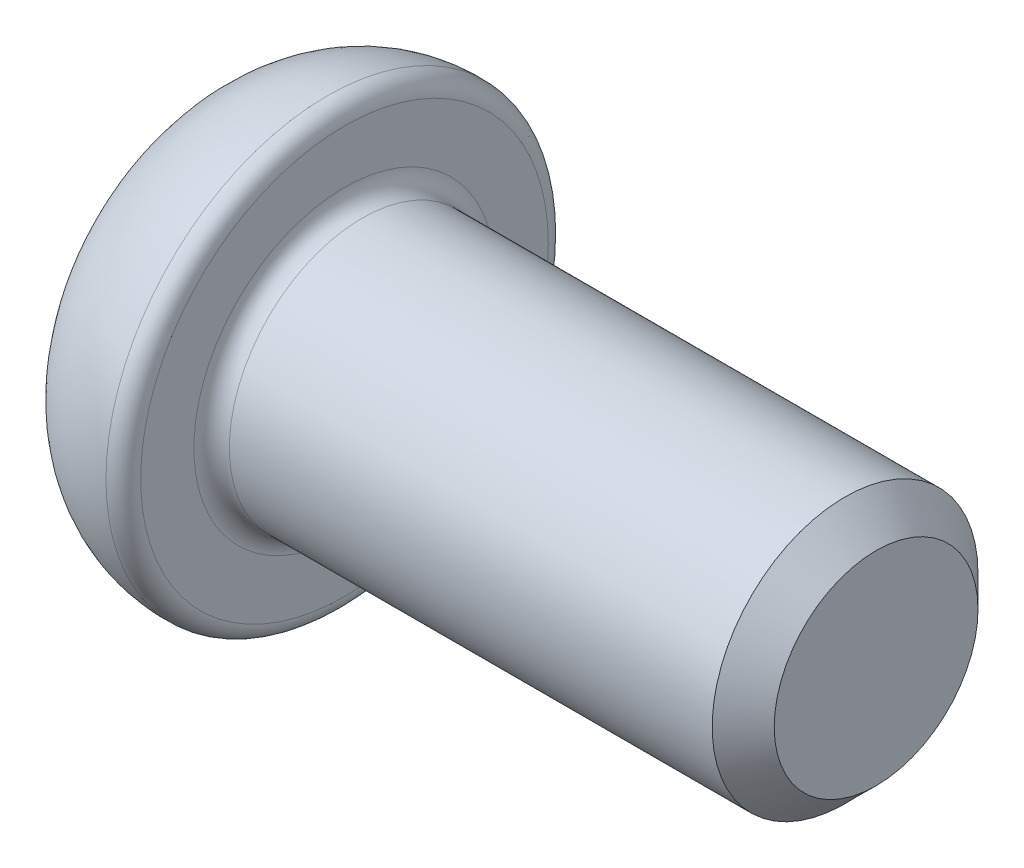
ISO-10303-21;
HEADER;
FILE_DESCRIPTION(('STEP AP214'),'2;1');
FILE_NAME('part.step','',(''),(''),'','','');
FILE_SCHEMA(('AUTOMOTIVE_DESIGN { 1 0 10303 214 1 1 1 1 }'));
ENDSEC;
DATA;
#1=APPLICATION_CONTEXT('core data for automotive mechanical design processes');
#2=APPLICATION_PROTOCOL_DEFINITION('international standard','automotive_design',2000,#1);
#3=PRODUCT_CONTEXT('',#1,'mechanical');
#4=PRODUCT('Part','Part','',(#3));
#5=PRODUCT_RELATED_PRODUCT_CATEGORY('part','',(#4));
#6=PRODUCT_DEFINITION_FORMATION('','',#4);
#7=PRODUCT_DEFINITION_CONTEXT('part definition',#1,'design');
#8=PRODUCT_DEFINITION('design','',#6,#7);
#9=PRODUCT_DEFINITION_SHAPE('','',#8);
#10=(LENGTH_UNIT() NAMED_UNIT(*) SI_UNIT(.MILLI.,.METRE.));
#11=(NAMED_UNIT(*) PLANE_ANGLE_UNIT() SI_UNIT($,.RADIAN.));
#12=(NAMED_UNIT(*) SI_UNIT($,.STERADIAN.) SOLID_ANGLE_UNIT());
#13=UNCERTAINTY_MEASURE_WITH_UNIT(LENGTH_MEASURE(1.E-05),#10,'distance_accuracy_value','');
#14=(GEOMETRIC_REPRESENTATION_CONTEXT(3) GLOBAL_UNCERTAINTY_ASSIGNED_CONTEXT((#13)) GLOBAL_UNIT_ASSIGNED_CONTEXT((#10,
#11,#12)) REPRESENTATION_CONTEXT('',''));
#15=CARTESIAN_POINT('',(0.,0.,0.));
#16=DIRECTION('',(0.,0.,1.));
#17=DIRECTION('',(1.,0.,0.));
#18=AXIS2_PLACEMENT_3D('',#15,#16,#17);
#19=CARTESIAN_POINT('',(1.5,0.,0.));
#20=DIRECTION('',(1.,0.,0.));
#21=DIRECTION('',(0.,0.,-1.));
#22=AXIS2_PLACEMENT_3D('',#19,#20,#21);
#23=DEGENERATE_TOROIDAL_SURFACE('',#22,1.00110987806539,1.5,.T.);
#24=CARTESIAN_POINT('',(0.00789597542149041,-1.15481600843309,-0.000200000000000142));
#25=CARTESIAN_POINT('',(0.00542604693692045,-1.13076586513082,0.0414560701288516));
#26=CARTESIAN_POINT('',(0.00376082343034832,-1.10670231337504,0.0831353643804187));
#27=CARTESIAN_POINT('',(0.00148854197993975,-1.05856787998182,0.166506648611014));
#28=CARTESIAN_POINT('',(0.00088121307622223,-1.03449700180118,0.208198632602691));
#29=CARTESIAN_POINT('',(0.000172853298911107,-0.986360312777249,0.291573823700276));
#30=CARTESIAN_POINT('',(7.17121196707583E-05,-0.962294501972819,0.33325703073889));
#31=CARTESIAN_POINT('',(-1.45135273849101E-05,-0.914160928715452,0.416626825170486));
#32=CARTESIAN_POINT('',(4.10598332002454E-07,-0.890093166249946,0.458313412585243));
#33=CARTESIAN_POINT('',(4.10598331977648E-07,-0.841957641318932,0.541686587414757));
#34=CARTESIAN_POINT('',(-1.45135273849597E-05,-0.817889878853425,0.583373174829514));
#35=CARTESIAN_POINT('',(7.17121196706029E-05,-0.769756305596059,0.666742969261111));
#36=CARTESIAN_POINT('',(0.00017285329891087,-0.745690494791629,0.708426176299724));
#37=CARTESIAN_POINT('',(0.000881213076222171,-0.697553805767702,0.791801367397309));
#38=CARTESIAN_POINT('',(0.00148854197993995,-0.673482927587058,0.833493351388986));
#39=CARTESIAN_POINT('',(0.00376082343034881,-0.625348494193839,0.916864635619581));
#40=CARTESIAN_POINT('',(0.00542604693692098,-0.601284942438063,0.958543929871148));
#41=CARTESIAN_POINT('',(0.00789597542149057,-0.577234799135788,1.0002));
#42=B_SPLINE_CURVE_WITH_KNOTS('',3,(#24,#25,#26,#27,#28,#29,#30,#31,#32,#33,#34,#35,#36,#37,#38,
#39,#40,#41),.UNSPECIFIED.,.F.,.F.,(4,2,2,2,2,2,2,2,4),(0.,0.144464197898797,0.288891388556233,
0.433287105063312,0.577693512802,0.722099920540687,0.866495637047766,1.0109228277052,
1.155387025604),.UNSPECIFIED.);
#43=CARTESIAN_POINT('',(0.00788408323465527,-1.15470053837925,0.));
#44=VERTEX_POINT('',#43);
#45=CARTESIAN_POINT('',(0.,-0.889589083251513,0.45918650994976));
#46=VERTEX_POINT('',#45);
#47=EDGE_CURVE('E11',#44,#46,#42,.T.);
#48=ORIENTED_EDGE('',*,*,#47,.F.);
#49=CARTESIAN_POINT('',(0.00789597542149048,-0.577234799135788,-1.0002));
#50=CARTESIAN_POINT('',(0.00542604693692064,-0.601284942438063,-0.958543929871148));
#51=CARTESIAN_POINT('',(0.00376082343034845,-0.625348494193838,-0.916864635619581));
#52=CARTESIAN_POINT('',(0.00148854197993972,-0.673482927587058,-0.833493351388986));
#53=CARTESIAN_POINT('',(0.000881213076222073,-0.697553805767701,-0.791801367397309));
#54=CARTESIAN_POINT('',(0.000172853298910902,-0.745690494791629,-0.708426176299724));
#55=CARTESIAN_POINT('',(7.17121196706246E-05,-0.769756305596059,-0.66674296926111));
#56=CARTESIAN_POINT('',(-1.45135273849426E-05,-0.817889878853425,-0.583373174829514));
#57=CARTESIAN_POINT('',(4.10598331999777E-07,-0.841957641318932,-0.541686587414757));
#58=CARTESIAN_POINT('',(4.10598332010818E-07,-0.890093166249946,-0.458313412585243));
#59=CARTESIAN_POINT('',(-1.45135273849205E-05,-0.914160928715452,-0.416626825170486));
#60=CARTESIAN_POINT('',(7.17121196706303E-05,-0.962294501972819,-0.333257030738889));
#61=CARTESIAN_POINT('',(0.00017285329891088,-0.986360312777249,-0.291573823700276));
#62=CARTESIAN_POINT('',(0.000881213076222154,-1.03449700180118,-0.208198632602691));
#63=CARTESIAN_POINT('',(0.00148854197993993,-1.05856787998182,-0.166506648611014));
#64=CARTESIAN_POINT('',(0.00376082343034877,-1.10670231337504,-0.0831353643804187));
#65=CARTESIAN_POINT('',(0.00542604693692094,-1.13076586513082,-0.0414560701288516));
#66=CARTESIAN_POINT('',(0.00789597542149053,-1.15481600843309,0.000200000000000021));
#67=B_SPLINE_CURVE_WITH_KNOTS('',3,(#49,#50,#51,#52,#53,#54,#55,#56,#57,#58,#59,#60,#61,#62,#63,
#64,#65,#66),.UNSPECIFIED.,.F.,.F.,(4,2,2,2,2,2,2,2,4),(0.,0.144464197898797,0.288891388556234,
0.433287105063313,0.577693512802,0.722099920540687,0.866495637047766,1.0109228277052,
1.155387025604),.UNSPECIFIED.);
#68=CARTESIAN_POINT('',(0.,-0.889589083251518,-0.459186509949751));
#69=VERTEX_POINT('',#68);
#70=EDGE_CURVE('E43',#69,#44,#67,.T.);
#71=ORIENTED_EDGE('',*,*,#70,.F.);
#72=CARTESIAN_POINT('',(0.,-0.842461724317359,-0.540813490050249));
#73=DIRECTION('',(0.,-0.5,0.866025403784439));
#74=VECTOR('',#73,1.);
#75=LINE('',#72,#74);
#76=CARTESIAN_POINT('',(0.,-0.842461724317359,-0.540813490050249));
#77=VERTEX_POINT('',#76);
#78=EDGE_CURVE('E144',#77,#69,#75,.T.);
#79=ORIENTED_EDGE('',*,*,#78,.F.);
#80=CARTESIAN_POINT('',(0.00788408323376384,-0.577350269189626,-1.));
#81=VERTEX_POINT('',#80);
#82=EDGE_CURVE('E264',#81,#77,#67,.T.);
#83=ORIENTED_EDGE('',*,*,#82,.F.);
#84=CARTESIAN_POINT('',(4.10609829497004E-07,0.,-1.));
#85=CARTESIAN_POINT('',(4.42328466909666E-06,-0.0419085481983505,-1.));
#86=CARTESIAN_POINT('',(-8.21434623222068E-06,-0.0838172750016166,-1.));
#87=CARTESIAN_POINT('',(3.87033450213406E-05,-0.167634573211464,-1.));
#88=CARTESIAN_POINT('',(9.82597851806692E-05,-0.209543144605589,-1.));
#89=CARTESIAN_POINT('',(0.00070499754576417,-0.335320966161048,-1.));
#90=CARTESIAN_POINT('',(0.00168067618666049,-0.419193544498606,-1.));
#91=CARTESIAN_POINT('',(0.00764461151773026,-0.586406153161597,-1.));
#92=CARTESIAN_POINT('',(0.0126121175593781,-0.669746696638542,-1.));
#93=CARTESIAN_POINT('',(0.0295261331533725,-0.83570122525872,-1.));
#94=CARTESIAN_POINT('',(0.0414631931255666,-0.918316040720577,-1.));
#95=CARTESIAN_POINT('',(0.0674484119800398,-1.04662047620464,-1.));
#96=CARTESIAN_POINT('',(0.0783907820538363,-1.09293763971261,-1.));
#97=CARTESIAN_POINT('',(0.103556825018407,-1.18467655579779,-1.));
#98=CARTESIAN_POINT('',(0.117781082877188,-1.23009814717855,-1.));
#99=CARTESIAN_POINT('',(0.165760758650998,-1.36460143751692,-1.));
#100=CARTESIAN_POINT('',(0.204817216030264,-1.45189064493554,-1.));
#101=CARTESIAN_POINT('',(0.297974523825678,-1.61898394614429,-1.));
#102=CARTESIAN_POINT('',(0.35218893740739,-1.69872520656462,-1.));
#103=CARTESIAN_POINT('',(0.474746584485199,-1.84655126424678,-1.));
#104=CARTESIAN_POINT('',(0.543083058415181,-1.91464160985451,-1.));
#105=CARTESIAN_POINT('',(0.684131092322764,-2.02968523080252,-1.));
#106=CARTESIAN_POINT('',(0.755654633829852,-2.07809799081724,-1.));
#107=CARTESIAN_POINT('',(0.90631391180589,-2.16110111834147,-1.));
#108=CARTESIAN_POINT('',(0.985445927725428,-2.19569819950334,-1.));
#109=CARTESIAN_POINT('',(1.14268121771474,-2.24767649697595,-1.));
#110=CARTESIAN_POINT('',(1.2204280140045,-2.2661414153489,-1.));
#111=CARTESIAN_POINT('',(1.37794164210725,-2.2893773798721,-1.));
#112=CARTESIAN_POINT('',(1.4577081305444,-2.29415073821622,-1.));
#113=CARTESIAN_POINT('',(1.61481321599969,-2.28989106383948,-1.));
#114=CARTESIAN_POINT('',(1.69216161521913,-2.28120896786852,-1.));
#115=CARTESIAN_POINT('',(1.84428535209312,-2.25098736781229,-1.));
#116=CARTESIAN_POINT('',(1.91906121828266,-2.22945052166288,-1.));
#117=CARTESIAN_POINT('',(2.06402681386593,-2.17423016565249,-1.));
#118=CARTESIAN_POINT('',(2.13421369058889,-2.14053918359733,-1.));
#119=CARTESIAN_POINT('',(2.26814562319367,-2.06211005067895,-1.));
#120=CARTESIAN_POINT('',(2.33188754379213,-2.01736655918569,-1.));
#121=CARTESIAN_POINT('',(2.45291640379922,-1.91701521252381,-1.));
#122=CARTESIAN_POINT('',(2.50999648997609,-1.86115870114487,-1.));
#123=CARTESIAN_POINT('',(2.61456823729596,-1.74117330164202,-1.));
#124=CARTESIAN_POINT('',(2.66206708919118,-1.67705067695628,-1.));
#125=CARTESIAN_POINT('',(2.72702562083354,-1.57403618070324,-1.));
#126=CARTESIAN_POINT('',(2.7481384236323,-1.53738510277309,-1.));
#127=CARTESIAN_POINT('',(2.78750677747445,-1.46255172440874,-1.));
#128=CARTESIAN_POINT('',(2.80576108332104,-1.42436876571588,-1.));
#129=CARTESIAN_POINT('',(2.83943760801177,-1.34674627698638,-1.));
#130=CARTESIAN_POINT('',(2.85485770756991,-1.30730583231143,-1.));
#131=CARTESIAN_POINT('',(2.8829233055067,-1.2275111103957,-1.));
#132=CARTESIAN_POINT('',(2.8955721859095,-1.18715801410307,-1.));
#133=CARTESIAN_POINT('',(2.92560717994761,-1.07934741447146,-1.));
#134=CARTESIAN_POINT('',(2.94075595206167,-1.01126150436534,-1.));
#135=CARTESIAN_POINT('',(2.96494192659386,-0.873996935642961,-1.));
#136=CARTESIAN_POINT('',(2.97397312396569,-0.80481727134182,-1.));
#137=CARTESIAN_POINT('',(2.98735401044195,-0.665607037855779,-1.));
#138=CARTESIAN_POINT('',(2.99167430172838,-0.595573852365373,-1.));
#139=CARTESIAN_POINT('',(2.99728741707113,-0.455421423235627,-1.));
#140=CARTESIAN_POINT('',(2.99858056761844,-0.385302189693224,-1.));
#141=CARTESIAN_POINT('',(2.99993053679468,-0.244192605564413,-1.));
#142=CARTESIAN_POINT('',(2.99997185053451,-0.173202217949213,-1.));
#143=CARTESIAN_POINT('',(3.00001694198291,-0.0312208619107281,-1.));
#144=CARTESIAN_POINT('',(3.00002071942152,0.039770106513061,-1.));
#145=CARTESIAN_POINT('',(2.99996266590596,0.181536770271981,-1.));
#146=CARTESIAN_POINT('',(2.99990103318965,0.252312467826152,-1.));
#147=CARTESIAN_POINT('',(2.99844612985905,0.393847370817269,-1.));
#148=CARTESIAN_POINT('',(2.99705316400949,0.464606576321555,-1.));
#149=CARTESIAN_POINT('',(2.99192378887099,0.586513145111125,-1.));
#150=CARTESIAN_POINT('',(2.98893945435411,0.637688381554001,-1.));
#151=CARTESIAN_POINT('',(2.98061912505216,0.73986457254294,-1.));
#152=CARTESIAN_POINT('',(2.97528280912664,0.790865502330445,-1.));
#153=CARTESIAN_POINT('',(2.96169848596055,0.89211486764435,-1.));
#154=CARTESIAN_POINT('',(2.95347176321928,0.942366077494637,-1.));
#155=CARTESIAN_POINT('',(2.93361221871033,1.042206454069,-1.));
#156=CARTESIAN_POINT('',(2.9219790977349,1.09179556223581,-1.));
#157=CARTESIAN_POINT('',(2.8947305945394,1.19070100385389,-1.));
#158=CARTESIAN_POINT('',(2.87905668628379,1.24000139681552,-1.));
#159=CARTESIAN_POINT('',(2.84356272909895,1.33709264020247,-1.));
#160=CARTESIAN_POINT('',(2.82374288151627,1.38488356380511,-1.));
#161=CARTESIAN_POINT('',(2.77974479017018,1.47862905973547,-1.));
#162=CARTESIAN_POINT('',(2.75555196525035,1.52457684023912,-1.));
#163=CARTESIAN_POINT('',(2.70285432086212,1.61393265779753,-1.));
#164=CARTESIAN_POINT('',(2.67434828547126,1.65733997387812,-1.));
#165=CARTESIAN_POINT('',(2.58635679740163,1.77762818622872,-1.));
#166=CARTESIAN_POINT('',(2.52152071763535,1.8507191168117,-1.));
#167=CARTESIAN_POINT('',(2.37877862123073,1.98250688996699,-1.));
#168=CARTESIAN_POINT('',(2.30089758089029,2.0412307213557,-1.));
#169=CARTESIAN_POINT('',(2.14682688432694,2.13432108196425,-1.));
#170=CARTESIAN_POINT('',(2.07201589863319,2.1709799711724,-1.));
#171=CARTESIAN_POINT('',(1.91705219801623,2.23041477990244,-1.));
#172=CARTESIAN_POINT('',(1.83690038267347,2.25319303087973,-1.));
#173=CARTESIAN_POINT('',(1.67820474377137,2.28315919488511,-1.));
#174=CARTESIAN_POINT('',(1.59980556449175,2.29111836155545,-1.));
#175=CARTESIAN_POINT('',(1.44280709881501,2.29354898626556,-1.));
#176=CARTESIAN_POINT('',(1.36420785518463,2.28802311875751,-1.));
#177=CARTESIAN_POINT('',(1.21022850353374,2.26385733108434,-1.));
#178=CARTESIAN_POINT('',(1.13481825701316,2.24540853638331,-1.));
#179=CARTESIAN_POINT('',(0.988127045734917,2.19622704385844,-1.));
#180=CARTESIAN_POINT('',(0.916845924357541,2.16549481230102,-1.));
#181=CARTESIAN_POINT('',(0.779647528841495,2.09241553598221,-1.));
#182=CARTESIAN_POINT('',(0.713787766297451,2.04996072393427,-1.));
#183=CARTESIAN_POINT('',(0.589811841452605,1.95495464684614,-1.));
#184=CARTESIAN_POINT('',(0.531697259742535,1.9024013262889,-1.));
#185=CARTESIAN_POINT('',(0.422444112952196,1.78675251424863,-1.));
#186=CARTESIAN_POINT('',(0.371643728327023,1.72333860781315,-1.));
#187=CARTESIAN_POINT('',(0.280475002471462,1.58944242546201,-1.));
#188=CARTESIAN_POINT('',(0.240106223052175,1.51896044661974,-1.));
#189=CARTESIAN_POINT('',(0.18150951974811,1.39710092320635,-1.));
#190=CARTESIAN_POINT('',(0.160370151327829,1.34708755884065,-1.));
#191=CARTESIAN_POINT('',(0.122659052549425,1.24535059581546,-1.));
#192=CARTESIAN_POINT('',(0.106088737031122,1.19362647294786,-1.));
#193=CARTESIAN_POINT('',(0.0772291304296833,1.08896976671263,-1.));
#194=CARTESIAN_POINT('',(0.0649432341171994,1.03603626030924,-1.));
#195=CARTESIAN_POINT('',(0.0442125795154655,0.92941652834226,-1.));
#196=CARTESIAN_POINT('',(0.0357692328292896,0.875730033613839,-1.));
#197=CARTESIAN_POINT('',(0.0203517601727118,0.753916684990206,-1.));
#198=CARTESIAN_POINT('',(0.0143337812407774,0.685672328311677,-1.));
#199=CARTESIAN_POINT('',(0.00593818826136508,0.548962040855237,-1.));
#200=CARTESIAN_POINT('',(0.00356229213689224,0.480496020770095,-1.));
#201=CARTESIAN_POINT('',(0.00075099530834381,0.343345939481802,-1.));
#202=CARTESIAN_POINT('',(0.000321069133646188,0.274661806451856,-1.));
#203=CARTESIAN_POINT('',(-5.74283383478992E-05,0.137318609128501,-1.));
#204=CARTESIAN_POINT('',(-6.1634290621822E-06,0.0686595442598229,-1.));
#205=CARTESIAN_POINT('',(4.10609829497004E-07,0.,-1.));
#206=B_SPLINE_CURVE_WITH_KNOTS('',3,(#84,#85,#86,#87,#88,#89,#90,#91,#92,#93,#94,#95,#96,#97,
#98,#99,#100,#101,#102,#103,#104,#105,#106,#107,#108,#109,#110,#111,#112,#113,#114,#115,#116,
#117,#118,#119,#120,#121,#122,#123,#124,#125,#126,#127,#128,#129,#130,#131,#132,#133,#134,#135,
#136,#137,#138,#139,#140,#141,#142,#143,#144,#145,#146,#147,#148,#149,#150,#151,#152,#153,#154,
#155,#156,#157,#158,#159,#160,#161,#162,#163,#164,#165,#166,#167,#168,#169,#170,#171,#172,#173,
#174,#175,#176,#177,#178,#179,#180,#181,#182,#183,#184,#185,#186,#187,#188,#189,#190,#191,#192,
#193,#194,#195,#196,#197,#198,#199,#200,#201,#202,#203,#204,#205),.UNSPECIFIED.,.T.,.F.,(4,2,2,
2,2,2,2,2,2,2,2,2,2,2,2,2,2,2,2,2,2,2,2,2,2,2,2,2,2,2,2,2,2,2,2,2,2,2,2,2,2,2,2,2,2,2,2,2,2,2,2,
2,2,2,2,2,2,2,2,2,4),(0.,0.125725600479263,0.251453147982353,0.503054594322007,
0.753356540800835,1.00331990410247,1.14598386646117,1.28867327710386,1.57414581165066,
1.86181721597596,2.14935124313959,2.40707647549605,2.66467631485744,2.90323119064128,
3.14174577754614,3.37414346217923,3.60649311131931,3.83898584991656,4.07159115072732,
4.31014712126045,4.54852338300294,4.67530946378523,4.80215062143593,4.92908624245996,
5.05586607619062,5.26475303100698,5.47384473446465,5.68423391038394,5.89460039382262,
6.1075713645967,6.32054386706824,6.53287275433508,6.74515304755859,6.89890033687399,
7.05266862540932,7.20532753449955,7.35799985671252,7.51302156854871,7.66803575353944,
7.82357668312269,7.97916154269609,8.27031574685739,8.56091873990167,8.8095729026481,
9.05818528878566,9.29345214695918,9.52867234905339,9.76048522703471,9.9922893064769,
10.2262997307469,10.4603578375944,10.7030866564173,10.9458052775412,11.1084873887412,
11.2712198191887,11.4340808996802,11.5970017607904,11.8023759268642,12.0078469354806,
12.2138956306916,12.4198741911953),.UNSPECIFIED.);
#207=CARTESIAN_POINT('',(0.,-0.0471273589341589,-1.));
#208=VERTEX_POINT('',#207);
#209=EDGE_CURVE('E262',#208,#81,#206,.T.);
#210=ORIENTED_EDGE('',*,*,#209,.F.);
#211=CARTESIAN_POINT('',(0.,0.047127358934159,-1.));
#212=DIRECTION('',(0.,-1.,0.));
#213=VECTOR('',#212,1.);
#214=LINE('',#211,#213);
#215=CARTESIAN_POINT('',(0.,0.0471273589341589,-1.));
#216=VERTEX_POINT('',#215);
#217=EDGE_CURVE('E146',#216,#208,#214,.T.);
#218=ORIENTED_EDGE('',*,*,#217,.F.);
#219=CARTESIAN_POINT('',(0.00788408323465527,0.577350269189626,-1.));
#220=VERTEX_POINT('',#219);
#221=EDGE_CURVE('E259',#220,#216,#206,.T.);
#222=ORIENTED_EDGE('',*,*,#221,.F.);
#223=CARTESIAN_POINT('',(0.00789597542149051,1.15481600843309,0.000199999999999829));
#224=CARTESIAN_POINT('',(0.00542604693692092,1.13076586513082,-0.0414560701288518));
#225=CARTESIAN_POINT('',(0.00376082343034875,1.10670231337504,-0.0831353643804189));
#226=CARTESIAN_POINT('',(0.00148854197993991,1.05856787998182,-0.166506648611014));
#227=CARTESIAN_POINT('',(0.000881213076222141,1.03449700180118,-0.208198632602691));
#228=CARTESIAN_POINT('',(0.000172853298910869,0.986360312777249,-0.291573823700276));
#229=CARTESIAN_POINT('',(7.17121196706199E-05,0.962294501972819,-0.33325703073889));
#230=CARTESIAN_POINT('',(-1.45135273849321E-05,0.914160928715452,-0.416626825170486));
#231=CARTESIAN_POINT('',(4.10598331997919E-07,0.890093166249946,-0.458313412585243));
#232=CARTESIAN_POINT('',(4.10598331995735E-07,0.841957641318932,-0.541686587414757));
#233=CARTESIAN_POINT('',(-1.45135273849365E-05,0.817889878853425,-0.583373174829514));
#234=CARTESIAN_POINT('',(7.17121196706102E-05,0.769756305596059,-0.666742969261111));
#235=CARTESIAN_POINT('',(0.000172853298910857,0.745690494791629,-0.708426176299725));
#236=CARTESIAN_POINT('',(0.000881213076222119,0.697553805767701,-0.791801367397309));
#237=CARTESIAN_POINT('',(0.00148854197993988,0.673482927587057,-0.833493351388986));
#238=CARTESIAN_POINT('',(0.00376082343034872,0.625348494193838,-0.916864635619581));
#239=CARTESIAN_POINT('',(0.00542604693692088,0.601284942438063,-0.958543929871148));
#240=CARTESIAN_POINT('',(0.00789597542149048,0.577234799135788,-1.0002));
#241=B_SPLINE_CURVE_WITH_KNOTS('',3,(#223,#224,#225,#226,#227,#228,#229,#230,#231,#232,#233,
#234,#235,#236,#237,#238,#239,#240),.UNSPECIFIED.,.F.,.F.,(4,2,2,2,2,2,2,2,4),(0.,
0.144464197898797,0.288891388556233,0.433287105063312,0.577693512801999,0.722099920540687,
0.866495637047766,1.0109228277052,1.155387025604),.UNSPECIFIED.);
#242=CARTESIAN_POINT('',(0.,0.842461724317362,-0.540813490050245));
#243=VERTEX_POINT('',#242);
#244=EDGE_CURVE('E224',#243,#220,#241,.T.);
#245=ORIENTED_EDGE('',*,*,#244,.F.);
#246=CARTESIAN_POINT('',(0.,0.889589083251516,-0.459186509949755));
#247=DIRECTION('',(0.,-0.5,-0.866025403784438));
#248=VECTOR('',#247,1.);
#249=LINE('',#246,#248);
#250=CARTESIAN_POINT('',(0.,0.889589083251516,-0.459186509949755));
#251=VERTEX_POINT('',#250);
#252=EDGE_CURVE('E320',#251,#243,#249,.T.);
#253=ORIENTED_EDGE('',*,*,#252,.F.);
#254=CARTESIAN_POINT('',(0.00788408323465538,1.15470053837925,0.));
#255=VERTEX_POINT('',#254);
#256=EDGE_CURVE('E207',#255,#251,#241,.T.);
#257=ORIENTED_EDGE('',*,*,#256,.F.);
#258=CARTESIAN_POINT('',(0.00789597542149048,0.577234799135788,1.0002));
#259=CARTESIAN_POINT('',(0.00542604693692069,0.601284942438062,0.958543929871148));
#260=CARTESIAN_POINT('',(0.00376082343034853,0.625348494193838,0.916864635619581));
#261=CARTESIAN_POINT('',(0.00148854197993982,0.673482927587057,0.833493351388986));
#262=CARTESIAN_POINT('',(0.000881213076222175,0.697553805767701,0.791801367397309));
#263=CARTESIAN_POINT('',(0.000172853298910978,0.745690494791628,0.708426176299724));
#264=CARTESIAN_POINT('',(7.17121196706771E-05,0.769756305596059,0.66674296926111));
#265=CARTESIAN_POINT('',(-1.45135273848734E-05,0.817889878853425,0.583373174829514));
#266=CARTESIAN_POINT('',(4.1059833210915E-07,0.841957641318932,0.541686587414757));
#267=CARTESIAN_POINT('',(4.10598332026806E-07,0.890093166249946,0.458313412585243));
#268=CARTESIAN_POINT('',(-1.45135273850381E-05,0.914160928715452,0.416626825170486));
#269=CARTESIAN_POINT('',(7.1712119670553E-05,0.962294501972818,0.333257030738889));
#270=CARTESIAN_POINT('',(0.000172853298910977,0.986360312777249,0.291573823700275));
#271=CARTESIAN_POINT('',(0.000881213076222356,1.03449700180118,0.20819863260269));
#272=CARTESIAN_POINT('',(0.00148854197994006,1.05856787998182,0.166506648611014));
#273=CARTESIAN_POINT('',(0.0037608234303487,1.10670231337504,0.0831353643804185));
#274=CARTESIAN_POINT('',(0.00542604693692072,1.13076586513082,0.0414560701288514));
#275=CARTESIAN_POINT('',(0.00789597542149022,1.15481600843309,-0.000200000000000161));
#276=B_SPLINE_CURVE_WITH_KNOTS('',3,(#258,#259,#260,#261,#262,#263,#264,#265,#266,#267,#268,
#269,#270,#271,#272,#273,#274,#275),.UNSPECIFIED.,.F.,.F.,(4,2,2,2,2,2,2,2,4),(0.,
0.144464197898797,0.288891388556233,0.433287105063312,0.577693512802,0.722099920540687,
0.866495637047766,1.0109228277052,1.155387025604),.UNSPECIFIED.);
#277=CARTESIAN_POINT('',(0.,0.889589083251518,0.459186509949751));
#278=VERTEX_POINT('',#277);
#279=EDGE_CURVE('E205',#278,#255,#276,.T.);
#280=ORIENTED_EDGE('',*,*,#279,.F.);
#281=CARTESIAN_POINT('',(0.,0.842461724317359,0.540813490050249));
#282=DIRECTION('',(0.,0.5,-0.866025403784439));
#283=VECTOR('',#282,1.);
#284=LINE('',#281,#283);
#285=CARTESIAN_POINT('',(0.,0.842461724317359,0.540813490050249));
#286=VERTEX_POINT('',#285);
#287=EDGE_CURVE('E213',#286,#278,#284,.T.);
#288=ORIENTED_EDGE('',*,*,#287,.F.);
#289=CARTESIAN_POINT('',(0.00788408323376222,0.577350269189626,1.));
#290=VERTEX_POINT('',#289);
#291=EDGE_CURVE('E202',#290,#286,#276,.T.);
#292=ORIENTED_EDGE('',*,*,#291,.F.);
#293=CARTESIAN_POINT('',(4.10609829496979E-07,0.,1.));
#294=CARTESIAN_POINT('',(4.42328466910131E-06,0.0419085481983504,1.));
#295=CARTESIAN_POINT('',(-8.21434623220912E-06,0.0838172750016165,1.));
#296=CARTESIAN_POINT('',(3.87033450213767E-05,0.167634573211464,1.));
#297=CARTESIAN_POINT('',(9.82597851807228E-05,0.209543144605589,1.));
#298=CARTESIAN_POINT('',(0.000704997545764294,0.335320966161048,1.));
#299=CARTESIAN_POINT('',(0.00168067618666068,0.419193544498606,1.));
#300=CARTESIAN_POINT('',(0.00764461151773035,0.586406153161597,1.));
#301=CARTESIAN_POINT('',(0.012612117559378,0.669746696638542,1.));
#302=CARTESIAN_POINT('',(0.0295261331533723,0.83570122525872,1.));
#303=CARTESIAN_POINT('',(0.0414631931255666,0.918316040720577,1.));
#304=CARTESIAN_POINT('',(0.0674484119800398,1.04662047620464,1.));
#305=CARTESIAN_POINT('',(0.0783907820538363,1.09293763971261,1.));
#306=CARTESIAN_POINT('',(0.103556825018407,1.18467655579779,1.));
#307=CARTESIAN_POINT('',(0.117781082877188,1.23009814717855,1.));
#308=CARTESIAN_POINT('',(0.165760758650998,1.36460143751692,0.999999999999999));
#309=CARTESIAN_POINT('',(0.204817216030263,1.45189064493554,1.));
#310=CARTESIAN_POINT('',(0.297974523825678,1.61898394614429,1.));
#311=CARTESIAN_POINT('',(0.35218893740739,1.69872520656462,1.));
#312=CARTESIAN_POINT('',(0.474746584485199,1.84655126424678,1.));
#313=CARTESIAN_POINT('',(0.543083058415181,1.91464160985451,1.));
#314=CARTESIAN_POINT('',(0.684131092322763,2.02968523080252,1.));
#315=CARTESIAN_POINT('',(0.755654633829851,2.07809799081724,1.));
#316=CARTESIAN_POINT('',(0.90631391180589,2.16110111834147,1.));
#317=CARTESIAN_POINT('',(0.985445927725428,2.19569819950334,1.));
#318=CARTESIAN_POINT('',(1.14268121771474,2.24767649697595,1.));
#319=CARTESIAN_POINT('',(1.2204280140045,2.2661414153489,1.));
#320=CARTESIAN_POINT('',(1.37794164210725,2.2893773798721,1.));
#321=CARTESIAN_POINT('',(1.4577081305444,2.29415073821622,1.));
#322=CARTESIAN_POINT('',(1.61481321599969,2.28989106383948,1.));
#323=CARTESIAN_POINT('',(1.69216161521913,2.28120896786852,1.));
#324=CARTESIAN_POINT('',(1.84428535209312,2.25098736781229,1.));
#325=CARTESIAN_POINT('',(1.91906121828266,2.22945052166288,1.));
#326=CARTESIAN_POINT('',(2.06402681386593,2.17423016565249,1.));
#327=CARTESIAN_POINT('',(2.13421369058889,2.14053918359733,1.));
#328=CARTESIAN_POINT('',(2.26814562319367,2.06211005067895,1.));
#329=CARTESIAN_POINT('',(2.33188754379213,2.01736655918569,1.));
#330=CARTESIAN_POINT('',(2.45291640379922,1.91701521252381,1.));
#331=CARTESIAN_POINT('',(2.50999648997609,1.86115870114487,1.));
#332=CARTESIAN_POINT('',(2.61456823729596,1.74117330164202,1.));
#333=CARTESIAN_POINT('',(2.66206708919118,1.67705067695628,1.));
#334=CARTESIAN_POINT('',(2.72702562083354,1.57403618070324,1.));
#335=CARTESIAN_POINT('',(2.7481384236323,1.53738510277309,1.));
#336=CARTESIAN_POINT('',(2.78750677747445,1.46255172440873,1.));
#337=CARTESIAN_POINT('',(2.80576108332104,1.42436876571588,1.));
#338=CARTESIAN_POINT('',(2.83943760801178,1.34674627698638,1.));
#339=CARTESIAN_POINT('',(2.85485770756991,1.30730583231143,1.));
#340=CARTESIAN_POINT('',(2.8829233055067,1.2275111103957,1.));
#341=CARTESIAN_POINT('',(2.8955721859095,1.18715801410307,1.));
#342=CARTESIAN_POINT('',(2.92560717994761,1.07934741447146,1.));
#343=CARTESIAN_POINT('',(2.94075595206168,1.01126150436534,1.));
#344=CARTESIAN_POINT('',(2.96494192659386,0.87399693564296,1.));
#345=CARTESIAN_POINT('',(2.97397312396569,0.804817271341819,1.));
#346=CARTESIAN_POINT('',(2.98735401044195,0.665607037855778,1.));
#347=CARTESIAN_POINT('',(2.99167430172838,0.595573852365372,1.));
#348=CARTESIAN_POINT('',(2.99728741707113,0.455421423235626,1.));
#349=CARTESIAN_POINT('',(2.99858056761844,0.385302189693222,1.));
#350=CARTESIAN_POINT('',(2.99993053679468,0.244192605564411,1.));
#351=CARTESIAN_POINT('',(2.99997185053451,0.17320221794921,1.));
#352=CARTESIAN_POINT('',(3.00001694198291,0.0312208619107253,1.));
#353=CARTESIAN_POINT('',(3.00002071942152,-0.0397701065130639,1.));
#354=CARTESIAN_POINT('',(2.99996266590596,-0.181536770271984,1.));
#355=CARTESIAN_POINT('',(2.99990103318965,-0.252312467826156,1.));
#356=CARTESIAN_POINT('',(2.99844612985905,-0.393847370817274,1.));
#357=CARTESIAN_POINT('',(2.99705316400949,-0.46460657632156,1.));
#358=CARTESIAN_POINT('',(2.99192378887099,-0.586513145111129,1.));
#359=CARTESIAN_POINT('',(2.98893945435411,-0.637688381554006,1.));
#360=CARTESIAN_POINT('',(2.98061912505216,-0.739864572542944,1.));
#361=CARTESIAN_POINT('',(2.97528280912664,-0.790865502330448,1.));
#362=CARTESIAN_POINT('',(2.96169848596055,-0.892114867644354,1.));
#363=CARTESIAN_POINT('',(2.95347176321928,-0.942366077494641,1.));
#364=CARTESIAN_POINT('',(2.93361221871032,-1.042206454069,1.));
#365=CARTESIAN_POINT('',(2.9219790977349,-1.09179556223581,1.));
#366=CARTESIAN_POINT('',(2.8947305945394,-1.19070100385389,1.));
#367=CARTESIAN_POINT('',(2.87905668628379,-1.24000139681553,1.));
#368=CARTESIAN_POINT('',(2.84356272909895,-1.33709264020247,1.));
#369=CARTESIAN_POINT('',(2.82374288151627,-1.38488356380511,1.));
#370=CARTESIAN_POINT('',(2.77974479017018,-1.47862905973547,1.));
#371=CARTESIAN_POINT('',(2.75555196525035,-1.52457684023912,1.));
#372=CARTESIAN_POINT('',(2.70285432086212,-1.61393265779753,1.));
#373=CARTESIAN_POINT('',(2.67434828547126,-1.65733997387812,1.));
#374=CARTESIAN_POINT('',(2.58635679740163,-1.77762818622872,1.));
#375=CARTESIAN_POINT('',(2.52152071763535,-1.8507191168117,1.));
#376=CARTESIAN_POINT('',(2.37877862123073,-1.98250688996699,1.));
#377=CARTESIAN_POINT('',(2.30089758089029,-2.0412307213557,1.));
#378=CARTESIAN_POINT('',(2.14682688432694,-2.13432108196425,1.));
#379=CARTESIAN_POINT('',(2.07201589863319,-2.1709799711724,1.));
#380=CARTESIAN_POINT('',(1.91705219801622,-2.23041477990244,1.));
#381=CARTESIAN_POINT('',(1.83690038267347,-2.25319303087973,1.));
#382=CARTESIAN_POINT('',(1.67820474377137,-2.28315919488511,1.));
#383=CARTESIAN_POINT('',(1.59980556449175,-2.29111836155545,1.));
#384=CARTESIAN_POINT('',(1.44280709881501,-2.29354898626556,1.));
#385=CARTESIAN_POINT('',(1.36420785518462,-2.28802311875751,1.));
#386=CARTESIAN_POINT('',(1.21022850353373,-2.26385733108434,1.));
#387=CARTESIAN_POINT('',(1.13481825701316,-2.24540853638331,1.));
#388=CARTESIAN_POINT('',(0.988127045734916,-2.19622704385843,1.));
#389=CARTESIAN_POINT('',(0.916845924357541,-2.16549481230102,1.));
#390=CARTESIAN_POINT('',(0.779647528841495,-2.09241553598221,1.));
#391=CARTESIAN_POINT('',(0.71378776629745,-2.04996072393427,1.));
#392=CARTESIAN_POINT('',(0.589811841452605,-1.95495464684614,1.));
#393=CARTESIAN_POINT('',(0.531697259742535,-1.9024013262889,1.));
#394=CARTESIAN_POINT('',(0.422444112952195,-1.78675251424863,1.));
#395=CARTESIAN_POINT('',(0.371643728327022,-1.72333860781315,1.));
#396=CARTESIAN_POINT('',(0.280475002471462,-1.58944242546201,1.));
#397=CARTESIAN_POINT('',(0.240106223052175,-1.51896044661974,1.));
#398=CARTESIAN_POINT('',(0.18150951974811,-1.39710092320635,1.));
#399=CARTESIAN_POINT('',(0.160370151327829,-1.34708755884065,1.));
#400=CARTESIAN_POINT('',(0.122659052549424,-1.24535059581545,1.));
#401=CARTESIAN_POINT('',(0.106088737031122,-1.19362647294786,1.));
#402=CARTESIAN_POINT('',(0.0772291304296831,-1.08896976671263,1.));
#403=CARTESIAN_POINT('',(0.0649432341171991,-1.03603626030924,1.));
#404=CARTESIAN_POINT('',(0.0442125795154653,-0.929416528342259,1.));
#405=CARTESIAN_POINT('',(0.0357692328292895,-0.875730033613838,1.));
#406=CARTESIAN_POINT('',(0.0203517601727119,-0.753916684990205,1.));
#407=CARTESIAN_POINT('',(0.0143337812407774,-0.685672328311675,1.));
#408=CARTESIAN_POINT('',(0.00593818826136509,-0.548962040855236,1.));
#409=CARTESIAN_POINT('',(0.00356229213689225,-0.480496020770093,1.));
#410=CARTESIAN_POINT('',(0.000750995308343839,-0.343345939481801,1.));
#411=CARTESIAN_POINT('',(0.000321069133646199,-0.274661806451856,1.));
#412=CARTESIAN_POINT('',(-5.74283383479086E-05,-0.137318609128501,1.));
#413=CARTESIAN_POINT('',(-6.1634290621899E-06,-0.068659544259823,1.));
#414=CARTESIAN_POINT('',(4.10609829496979E-07,0.,1.));
#415=B_SPLINE_CURVE_WITH_KNOTS('',3,(#293,#294,#295,#296,#297,#298,#299,#300,#301,#302,#303,
#304,#305,#306,#307,#308,#309,#310,#311,#312,#313,#314,#315,#316,#317,#318,#319,#320,#321,#322,
#323,#324,#325,#326,#327,#328,#329,#330,#331,#332,#333,#334,#335,#336,#337,#338,#339,#340,#341,
#342,#343,#344,#345,#346,#347,#348,#349,#350,#351,#352,#353,#354,#355,#356,#357,#358,#359,#360,
#361,#362,#363,#364,#365,#366,#367,#368,#369,#370,#371,#372,#373,#374,#375,#376,#377,#378,#379,
#380,#381,#382,#383,#384,#385,#386,#387,#388,#389,#390,#391,#392,#393,#394,#395,#396,#397,#398,
#399,#400,#401,#402,#403,#404,#405,#406,#407,#408,#409,#410,#411,#412,#413,#414),.UNSPECIFIED.,
.T.,.F.,(4,2,2,2,2,2,2,2,2,2,2,2,2,2,2,2,2,2,2,2,2,2,2,2,2,2,2,2,2,2,2,2,2,2,2,2,2,2,2,2,2,2,2,
2,2,2,2,2,2,2,2,2,2,2,2,2,2,2,2,2,4),(0.,0.125725600479263,0.251453147982353,0.503054594322007,
0.753356540800835,1.00331990410246,1.14598386646117,1.28867327710386,1.57414581165066,
1.86181721597596,2.14935124313959,2.40707647549605,2.66467631485744,2.90323119064128,
3.14174577754614,3.37414346217923,3.60649311131931,3.83898584991656,4.07159115072732,
4.31014712126045,4.54852338300294,4.67530946378523,4.80215062143593,4.92908624245996,
5.05586607619062,5.26475303100698,5.47384473446465,5.68423391038394,5.89460039382262,
6.1075713645967,6.32054386706825,6.53287275433508,6.7451530475586,6.898900336874,
7.05266862540933,7.20532753449955,7.35799985671252,7.51302156854871,7.66803575353944,
7.82357668312269,7.9791615426961,8.27031574685739,8.56091873990168,8.8095729026481,
9.05818528878566,9.29345214695919,9.52867234905339,9.76048522703472,9.9922893064769,
10.2262997307469,10.4603578375944,10.7030866564173,10.9458052775412,11.1084873887412,
11.2712198191887,11.4340808996802,11.5970017607904,11.8023759268642,12.0078469354806,
12.2138956306916,12.4198741911953),.UNSPECIFIED.);
#416=CARTESIAN_POINT('',(0.,0.0471273589341636,1.));
#417=VERTEX_POINT('',#416);
#418=EDGE_CURVE('E311',#417,#290,#415,.T.);
#419=ORIENTED_EDGE('',*,*,#418,.F.);
#420=CARTESIAN_POINT('',(0.,-0.0471273589341632,1.));
#421=DIRECTION('',(0.,1.,0.));
#422=VECTOR('',#421,1.);
#423=LINE('',#420,#422);
#424=CARTESIAN_POINT('',(0.,-0.0471273589341632,1.));
#425=VERTEX_POINT('',#424);
#426=EDGE_CURVE('E317',#425,#417,#423,.T.);
#427=ORIENTED_EDGE('',*,*,#426,.F.);
#428=CARTESIAN_POINT('',(0.00788408323469953,-0.577350269189628,1.));
#429=VERTEX_POINT('',#428);
#430=EDGE_CURVE('E312',#429,#425,#415,.T.);
#431=ORIENTED_EDGE('',*,*,#430,.F.);
#432=CARTESIAN_POINT('',(0.,-0.842461724317366,0.540813490050239));
#433=VERTEX_POINT('',#432);
#434=EDGE_CURVE('E127',#433,#429,#42,.T.);
#435=ORIENTED_EDGE('',*,*,#434,.F.);
#436=CARTESIAN_POINT('',(0.,-0.889589083251513,0.45918650994976));
#437=DIRECTION('',(0.,0.5,0.866025403784439));
#438=VECTOR('',#437,1.);
#439=LINE('',#436,#438);
#440=EDGE_CURVE('E315',#46,#433,#439,.T.);
#441=ORIENTED_EDGE('',*,*,#440,.F.);
#442=EDGE_LOOP('',(#48,#71,#79,#83,#210,#218,#222,#245,#253,#257,#280,#288,#292,#419,#427,#431,
#435,#441));
#443=FACE_BOUND('',#442,.T.);
#444=CARTESIAN_POINT('',(1.55769230769231,0.,0.));
#445=DIRECTION('',(1.,0.,0.));
#446=DIRECTION('',(0.,0.,-1.));
#447=AXIS2_PLACEMENT_3D('',#444,#445,#446);
#448=CIRCLE('',#447,2.5);
#449=CARTESIAN_POINT('',(1.55769230769231,0.,-2.5));
#450=VERTEX_POINT('',#449);
#451=EDGE_CURVE('E347',#450,#450,#448,.T.);
#452=ORIENTED_EDGE('',*,*,#451,.F.);
#453=EDGE_LOOP('',(#452));
#454=FACE_BOUND('',#453,.T.);
#455=ADVANCED_FACE('F33',(#443,#454),#23,.T.);
#456=CARTESIAN_POINT('',(1.55,0.,0.));
#457=DIRECTION('',(1.,0.,0.));
#458=DIRECTION('',(0.,0.,-1.));
#459=AXIS2_PLACEMENT_3D('',#456,#457,#458);
#460=TOROIDAL_SURFACE('',#459,2.30014798374205,0.200000000000001);
#461=ORIENTED_EDGE('',*,*,#451,.T.);
#462=EDGE_LOOP('',(#461));
#463=FACE_BOUND('',#462,.T.);
#464=CARTESIAN_POINT('',(1.75,0.,0.));
#465=DIRECTION('',(1.,0.,0.));
#466=DIRECTION('',(0.,0.,-1.));
#467=AXIS2_PLACEMENT_3D('',#464,#465,#466);
#468=CIRCLE('',#467,2.30014798374205);
#469=CARTESIAN_POINT('',(1.75,0.,-2.30014798374205));
#470=VERTEX_POINT('',#469);
#471=EDGE_CURVE('E349',#470,#470,#468,.T.);
#472=ORIENTED_EDGE('',*,*,#471,.F.);
#473=EDGE_LOOP('',(#472));
#474=FACE_BOUND('',#473,.T.);
#475=ADVANCED_FACE('F389',(#463,#474),#460,.T.);
#476=CARTESIAN_POINT('',(1.75,2.30014798374205,0.));
#477=DIRECTION('',(1.,0.,0.));
#478=DIRECTION('',(0.,0.,-1.));
#479=AXIS2_PLACEMENT_3D('',#476,#477,#478);
#480=PLANE('',#479);
#481=ORIENTED_EDGE('',*,*,#471,.T.);
#482=EDGE_LOOP('',(#481));
#483=FACE_BOUND('',#482,.T.);
#484=CARTESIAN_POINT('',(1.75,0.,0.));
#485=DIRECTION('',(1.,0.,0.));
#486=DIRECTION('',(0.,0.,-1.));
#487=AXIS2_PLACEMENT_3D('',#484,#485,#486);
#488=CIRCLE('',#487,1.7);
#489=CARTESIAN_POINT('',(1.75,0.,-1.7));
#490=VERTEX_POINT('',#489);
#491=EDGE_CURVE('E353',#490,#490,#488,.T.);
#492=ORIENTED_EDGE('',*,*,#491,.F.);
#493=EDGE_LOOP('',(#492));
#494=FACE_BOUND('',#493,.T.);
#495=ADVANCED_FACE('F393',(#483,#494),#480,.T.);
#496=CARTESIAN_POINT('',(1.95,0.,0.));
#497=DIRECTION('',(1.,0.,0.));
#498=DIRECTION('',(0.,0.,-1.));
#499=AXIS2_PLACEMENT_3D('',#496,#497,#498);
#500=TOROIDAL_SURFACE('',#499,1.7,0.2);
#501=ORIENTED_EDGE('',*,*,#491,.T.);
#502=EDGE_LOOP('',(#501));
#503=FACE_BOUND('',#502,.T.);
#504=CARTESIAN_POINT('',(1.95,0.,0.));
#505=DIRECTION('',(1.,0.,0.));
#506=DIRECTION('',(0.,0.,-1.));
#507=AXIS2_PLACEMENT_3D('',#504,#505,#506);
#508=CIRCLE('',#507,1.5);
#509=CARTESIAN_POINT('',(1.95,0.,-1.5));
#510=VERTEX_POINT('',#509);
#511=EDGE_CURVE('E358',#510,#510,#508,.T.);
#512=ORIENTED_EDGE('',*,*,#511,.F.);
#513=EDGE_LOOP('',(#512));
#514=FACE_BOUND('',#513,.T.);
#515=ADVANCED_FACE('F385',(#503,#514),#500,.F.);
#516=CARTESIAN_POINT('',(0.,0.,0.));
#517=DIRECTION('',(1.,0.,0.));
#518=DIRECTION('',(0.,0.,-1.));
#519=AXIS2_PLACEMENT_3D('',#516,#517,#518);
#520=CYLINDRICAL_SURFACE('',#519,1.5);
#521=ORIENTED_EDGE('',*,*,#511,.T.);
#522=EDGE_LOOP('',(#521));
#523=FACE_BOUND('',#522,.T.);
#524=CARTESIAN_POINT('',(7.4,0.,0.));
#525=DIRECTION('',(1.,0.,0.));
#526=DIRECTION('',(0.,0.,-1.));
#527=AXIS2_PLACEMENT_3D('',#524,#525,#526);
#528=CIRCLE('',#527,1.5);
#529=CARTESIAN_POINT('',(7.4,0.,-1.5));
#530=VERTEX_POINT('',#529);
#531=EDGE_CURVE('E361',#530,#530,#528,.T.);
#532=ORIENTED_EDGE('',*,*,#531,.F.);
#533=EDGE_LOOP('',(#532));
#534=FACE_BOUND('',#533,.T.);
#535=ADVANCED_FACE('F378',(#523,#534),#520,.T.);
#536=CARTESIAN_POINT('',(7.75,0.,0.));
#537=DIRECTION('',(-1.,0.,0.));
#538=DIRECTION('',(0.,0.,1.));
#539=AXIS2_PLACEMENT_3D('',#536,#537,#538);
#540=CONICAL_SURFACE('',#539,1.15,0.785398163397452);
#541=ORIENTED_EDGE('',*,*,#531,.T.);
#542=EDGE_LOOP('',(#541));
#543=FACE_BOUND('',#542,.T.);
#544=CARTESIAN_POINT('',(7.75,0.,0.));
#545=DIRECTION('',(1.,0.,0.));
#546=DIRECTION('',(0.,0.,-1.));
#547=AXIS2_PLACEMENT_3D('',#544,#545,#546);
#548=CIRCLE('',#547,1.15);
#549=CARTESIAN_POINT('',(7.75,0.,-1.15));
#550=VERTEX_POINT('',#549);
#551=EDGE_CURVE('E157',#550,#550,#548,.T.);
#552=ORIENTED_EDGE('',*,*,#551,.F.);
#553=EDGE_LOOP('',(#552));
#554=FACE_BOUND('',#553,.T.);
#555=ADVANCED_FACE('F376',(#543,#554),#540,.T.);
#556=CARTESIAN_POINT('',(7.75,1.15,0.));
#557=DIRECTION('',(1.,0.,0.));
#558=DIRECTION('',(0.,0.,-1.));
#559=AXIS2_PLACEMENT_3D('',#556,#557,#558);
#560=PLANE('',#559);
#561=ORIENTED_EDGE('',*,*,#551,.T.);
#562=EDGE_LOOP('',(#561));
#563=FACE_BOUND('',#562,.T.);
#564=ADVANCED_FACE('F374',(#563),#560,.T.);
#565=CARTESIAN_POINT('',(0.9,-1.15470053837925,0.));
#566=DIRECTION('',(0.,-0.866025403784439,0.5));
#567=DIRECTION('',(0.,-0.5,-0.866025403784439));
#568=AXIS2_PLACEMENT_3D('',#565,#566,#567);
#569=PLANE('',#568);
#570=ORIENTED_EDGE('',*,*,#47,.T.);
#571=ORIENTED_EDGE('',*,*,#440,.T.);
#572=ORIENTED_EDGE('',*,*,#434,.T.);
#573=DIRECTION('',(-1.,0.,0.));
#574=VECTOR('',#573,1.);
#575=CARTESIAN_POINT('',(0.9,-0.577350269189626,1.));
#576=LINE('',#575,#574);
#577=CARTESIAN_POINT('',(0.9,-0.577350269189626,1.));
#578=VERTEX_POINT('',#577);
#579=EDGE_CURVE('E51',#578,#429,#576,.T.);
#580=ORIENTED_EDGE('',*,*,#579,.F.);
#581=DIRECTION('',(0.,0.5,0.866025403784439));
#582=VECTOR('',#581,1.);
#583=CARTESIAN_POINT('',(0.9,-1.15470053837925,0.));
#584=LINE('',#583,#582);
#585=CARTESIAN_POINT('',(0.9,-1.15470053837925,0.));
#586=VERTEX_POINT('',#585);
#587=EDGE_CURVE('E124',#586,#578,#584,.T.);
#588=ORIENTED_EDGE('',*,*,#587,.F.);
#589=DIRECTION('',(-1.,0.,0.));
#590=VECTOR('',#589,1.);
#591=CARTESIAN_POINT('',(0.9,-1.15470053837925,0.));
#592=LINE('',#591,#590);
#593=EDGE_CURVE('E155',#586,#44,#592,.T.);
#594=ORIENTED_EDGE('',*,*,#593,.T.);
#595=EDGE_LOOP('',(#570,#571,#572,#580,#588,#594));
#596=FACE_BOUND('',#595,.T.);
#597=ADVANCED_FACE('F122',(#596),#569,.F.);
#598=CARTESIAN_POINT('',(0.9,-0.577350269189626,-1.));
#599=DIRECTION('',(0.,-0.866025403784439,-0.5));
#600=DIRECTION('',(0.,0.5,-0.866025403784439));
#601=AXIS2_PLACEMENT_3D('',#598,#599,#600);
#602=PLANE('',#601);
#603=ORIENTED_EDGE('',*,*,#82,.T.);
#604=ORIENTED_EDGE('',*,*,#78,.T.);
#605=ORIENTED_EDGE('',*,*,#70,.T.);
#606=ORIENTED_EDGE('',*,*,#593,.F.);
#607=DIRECTION('',(0.,-0.5,0.866025403784438));
#608=VECTOR('',#607,1.);
#609=CARTESIAN_POINT('',(0.9,-0.577350269189626,-1.));
#610=LINE('',#609,#608);
#611=CARTESIAN_POINT('',(0.9,-0.577350269189626,-1.));
#612=VERTEX_POINT('',#611);
#613=EDGE_CURVE('E130',#612,#586,#610,.T.);
#614=ORIENTED_EDGE('',*,*,#613,.F.);
#615=DIRECTION('',(-1.,0.,0.));
#616=VECTOR('',#615,1.);
#617=CARTESIAN_POINT('',(0.9,-0.577350269189626,-1.));
#618=LINE('',#617,#616);
#619=EDGE_CURVE('E158',#612,#81,#618,.T.);
#620=ORIENTED_EDGE('',*,*,#619,.T.);
#621=EDGE_LOOP('',(#603,#604,#605,#606,#614,#620));
#622=FACE_BOUND('',#621,.T.);
#623=ADVANCED_FACE('F289',(#622),#602,.F.);
#624=CARTESIAN_POINT('',(0.9,0.577350269189626,-1.));
#625=DIRECTION('',(0.,0.,-1.));
#626=DIRECTION('',(-1.,0.,0.));
#627=AXIS2_PLACEMENT_3D('',#624,#625,#626);
#628=PLANE('',#627);
#629=ORIENTED_EDGE('',*,*,#209,.T.);
#630=ORIENTED_EDGE('',*,*,#619,.F.);
#631=DIRECTION('',(0.,-1.,0.));
#632=VECTOR('',#631,1.);
#633=CARTESIAN_POINT('',(0.9,0.577350269189626,-1.));
#634=LINE('',#633,#632);
#635=CARTESIAN_POINT('',(0.9,0.577350269189626,-1.));
#636=VERTEX_POINT('',#635);
#637=EDGE_CURVE('E152',#636,#612,#634,.T.);
#638=ORIENTED_EDGE('',*,*,#637,.F.);
#639=DIRECTION('',(-1.,0.,0.));
#640=VECTOR('',#639,1.);
#641=CARTESIAN_POINT('',(0.9,0.577350269189626,-1.));
#642=LINE('',#641,#640);
#643=EDGE_CURVE('E161',#636,#220,#642,.T.);
#644=ORIENTED_EDGE('',*,*,#643,.T.);
#645=ORIENTED_EDGE('',*,*,#221,.T.);
#646=ORIENTED_EDGE('',*,*,#217,.T.);
#647=EDGE_LOOP('',(#629,#630,#638,#644,#645,#646));
#648=FACE_BOUND('',#647,.T.);
#649=ADVANCED_FACE('F239',(#648),#628,.F.);
#650=CARTESIAN_POINT('',(0.9,1.15470053837925,0.));
#651=DIRECTION('',(0.,0.866025403784439,-0.5));
#652=DIRECTION('',(0.,0.5,0.866025403784439));
#653=AXIS2_PLACEMENT_3D('',#650,#651,#652);
#654=PLANE('',#653);
#655=ORIENTED_EDGE('',*,*,#256,.T.);
#656=ORIENTED_EDGE('',*,*,#252,.T.);
#657=ORIENTED_EDGE('',*,*,#244,.T.);
#658=ORIENTED_EDGE('',*,*,#643,.F.);
#659=DIRECTION('',(0.,-0.5,-0.866025403784439));
#660=VECTOR('',#659,1.);
#661=CARTESIAN_POINT('',(0.9,1.15470053837925,0.));
#662=LINE('',#661,#660);
#663=CARTESIAN_POINT('',(0.9,1.15470053837925,0.));
#664=VERTEX_POINT('',#663);
#665=EDGE_CURVE('E149',#664,#636,#662,.T.);
#666=ORIENTED_EDGE('',*,*,#665,.F.);
#667=DIRECTION('',(-1.,0.,0.));
#668=VECTOR('',#667,1.);
#669=CARTESIAN_POINT('',(0.9,1.15470053837925,0.));
#670=LINE('',#669,#668);
#671=EDGE_CURVE('E164',#664,#255,#670,.T.);
#672=ORIENTED_EDGE('',*,*,#671,.T.);
#673=EDGE_LOOP('',(#655,#656,#657,#658,#666,#672));
#674=FACE_BOUND('',#673,.T.);
#675=ADVANCED_FACE('F235',(#674),#654,.F.);
#676=CARTESIAN_POINT('',(0.9,0.577350269189626,1.));
#677=DIRECTION('',(0.,0.866025403784438,0.5));
#678=DIRECTION('',(0.,-0.5,0.866025403784439));
#679=AXIS2_PLACEMENT_3D('',#676,#677,#678);
#680=PLANE('',#679);
#681=ORIENTED_EDGE('',*,*,#291,.T.);
#682=ORIENTED_EDGE('',*,*,#287,.T.);
#683=ORIENTED_EDGE('',*,*,#279,.T.);
#684=ORIENTED_EDGE('',*,*,#671,.F.);
#685=DIRECTION('',(0.,0.5,-0.866025403784439));
#686=VECTOR('',#685,1.);
#687=CARTESIAN_POINT('',(0.9,0.577350269189626,1.));
#688=LINE('',#687,#686);
#689=CARTESIAN_POINT('',(0.9,0.577350269189626,1.));
#690=VERTEX_POINT('',#689);
#691=EDGE_CURVE('E139',#690,#664,#688,.T.);
#692=ORIENTED_EDGE('',*,*,#691,.F.);
#693=DIRECTION('',(-1.,0.,0.));
#694=VECTOR('',#693,1.);
#695=CARTESIAN_POINT('',(0.9,0.577350269189626,1.));
#696=LINE('',#695,#694);
#697=EDGE_CURVE('E129',#690,#290,#696,.T.);
#698=ORIENTED_EDGE('',*,*,#697,.T.);
#699=EDGE_LOOP('',(#681,#682,#683,#684,#692,#698));
#700=FACE_BOUND('',#699,.T.);
#701=ADVANCED_FACE('F180',(#700),#680,.F.);
#702=CARTESIAN_POINT('',(0.9,-0.577350269189626,1.));
#703=DIRECTION('',(0.,0.,1.));
#704=DIRECTION('',(0.,-1.,0.));
#705=AXIS2_PLACEMENT_3D('',#702,#703,#704);
#706=PLANE('',#705);
#707=ORIENTED_EDGE('',*,*,#418,.T.);
#708=ORIENTED_EDGE('',*,*,#697,.F.);
#709=DIRECTION('',(0.,1.,0.));
#710=VECTOR('',#709,1.);
#711=CARTESIAN_POINT('',(0.9,-0.577350269189626,1.));
#712=LINE('',#711,#710);
#713=EDGE_CURVE('E133',#578,#690,#712,.T.);
#714=ORIENTED_EDGE('',*,*,#713,.F.);
#715=ORIENTED_EDGE('',*,*,#579,.T.);
#716=ORIENTED_EDGE('',*,*,#430,.T.);
#717=ORIENTED_EDGE('',*,*,#426,.T.);
#718=EDGE_LOOP('',(#707,#708,#714,#715,#716,#717));
#719=FACE_BOUND('',#718,.T.);
#720=ADVANCED_FACE('F134',(#719),#706,.F.);
#721=CARTESIAN_POINT('',(0.9,0.,0.));
#722=DIRECTION('',(-1.,0.,0.));
#723=DIRECTION('',(0.,0.,1.));
#724=AXIS2_PLACEMENT_3D('',#721,#722,#723);
#725=PLANE('',#724);
#726=ORIENTED_EDGE('',*,*,#587,.T.);
#727=ORIENTED_EDGE('',*,*,#713,.T.);
#728=ORIENTED_EDGE('',*,*,#691,.T.);
#729=ORIENTED_EDGE('',*,*,#665,.T.);
#730=ORIENTED_EDGE('',*,*,#637,.T.);
#731=ORIENTED_EDGE('',*,*,#613,.T.);
#732=EDGE_LOOP('',(#726,#727,#728,#729,#730,#731));
#733=FACE_BOUND('',#732,.T.);
#734=ADVANCED_FACE('F141',(#733),#725,.T.);
#735=CLOSED_SHELL('',(#455,#475,#495,#515,#535,#555,#564,#597,#623,#649,#675,#701,#720,#734));
#736=MANIFOLD_SOLID_BREP('B2',#735);
#737=ADVANCED_BREP_SHAPE_REPRESENTATION('',(#18,#736),#14);
#738=SHAPE_DEFINITION_REPRESENTATION(#9,#737);
ENDSEC;
END-ISO-10303-21;
